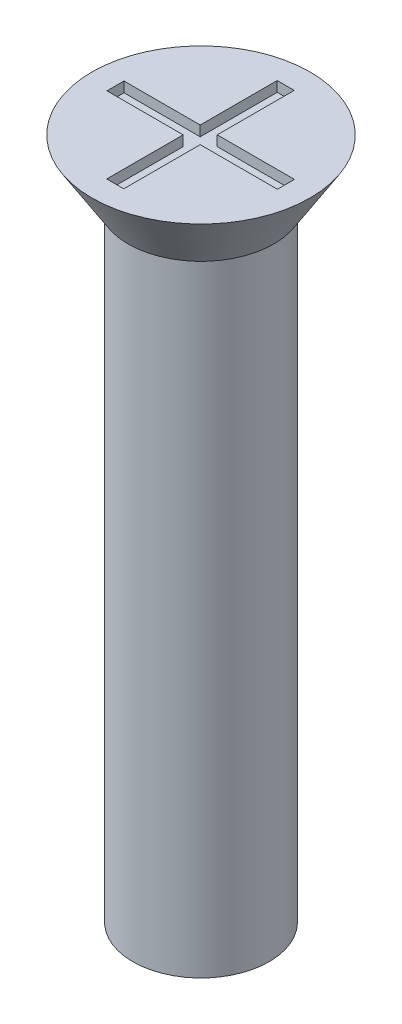
ISO-10303-21;
HEADER;
FILE_DESCRIPTION(('STEP AP214'),'2;1');
FILE_NAME('part.step','',(''),(''),'','','');
FILE_SCHEMA(('AUTOMOTIVE_DESIGN { 1 0 10303 214 1 1 1 1 }'));
ENDSEC;
DATA;
#1=APPLICATION_CONTEXT('core data for automotive mechanical design processes');
#2=APPLICATION_PROTOCOL_DEFINITION('international standard','automotive_design',2000,#1);
#3=PRODUCT_CONTEXT('',#1,'mechanical');
#4=PRODUCT('Part','Part','',(#3));
#5=PRODUCT_RELATED_PRODUCT_CATEGORY('part','',(#4));
#6=PRODUCT_DEFINITION_FORMATION('','',#4);
#7=PRODUCT_DEFINITION_CONTEXT('part definition',#1,'design');
#8=PRODUCT_DEFINITION('design','',#6,#7);
#9=PRODUCT_DEFINITION_SHAPE('','',#8);
#10=(LENGTH_UNIT() NAMED_UNIT(*) SI_UNIT(.MILLI.,.METRE.));
#11=(NAMED_UNIT(*) PLANE_ANGLE_UNIT() SI_UNIT($,.RADIAN.));
#12=(NAMED_UNIT(*) SI_UNIT($,.STERADIAN.) SOLID_ANGLE_UNIT());
#13=UNCERTAINTY_MEASURE_WITH_UNIT(LENGTH_MEASURE(1.E-05),#10,'distance_accuracy_value','');
#14=(GEOMETRIC_REPRESENTATION_CONTEXT(3) GLOBAL_UNCERTAINTY_ASSIGNED_CONTEXT((#13)) GLOBAL_UNIT_ASSIGNED_CONTEXT((#10,
#11,#12)) REPRESENTATION_CONTEXT('',''));
#15=CARTESIAN_POINT('',(0.,0.,0.));
#16=DIRECTION('',(0.,0.,1.));
#17=DIRECTION('',(1.,0.,0.));
#18=AXIS2_PLACEMENT_3D('',#15,#16,#17);
#19=CARTESIAN_POINT('',(0.,20.,0.));
#20=DIRECTION('',(0.,1.,0.));
#21=DIRECTION('',(0.,0.,1.));
#22=AXIS2_PLACEMENT_3D('',#19,#20,#21);
#23=PLANE('',#22);
#24=CARTESIAN_POINT('',(0.,20.,0.));
#25=DIRECTION('',(0.,1.,0.));
#26=DIRECTION('',(0.,0.,1.));
#27=AXIS2_PLACEMENT_3D('',#24,#25,#26);
#28=CIRCLE('',#27,3.2);
#29=CARTESIAN_POINT('',(0.,20.,3.2));
#30=VERTEX_POINT('',#29);
#31=EDGE_CURVE('E192',#30,#30,#28,.T.);
#32=ORIENTED_EDGE('',*,*,#31,.T.);
#33=EDGE_LOOP('',(#32));
#34=FACE_BOUND('',#33,.T.);
#35=DIRECTION('',(1.,0.,0.));
#36=VECTOR('',#35,1.);
#37=CARTESIAN_POINT('',(0.,20.,-2.5));
#38=LINE('',#37,#36);
#39=CARTESIAN_POINT('',(-0.265272843023468,20.,-2.5));
#40=VERTEX_POINT('',#39);
#41=CARTESIAN_POINT('',(0.234727156976532,20.,-2.5));
#42=VERTEX_POINT('',#41);
#43=EDGE_CURVE('E161',#40,#42,#38,.T.);
#44=ORIENTED_EDGE('',*,*,#43,.T.);
#45=DIRECTION('',(0.,0.,1.));
#46=VECTOR('',#45,1.);
#47=CARTESIAN_POINT('',(0.234727156976532,20.,0.));
#48=LINE('',#47,#46);
#49=CARTESIAN_POINT('',(0.234727156976532,20.,-0.241621514992573));
#50=VERTEX_POINT('',#49);
#51=EDGE_CURVE('E48',#42,#50,#48,.T.);
#52=ORIENTED_EDGE('',*,*,#51,.T.);
#53=DIRECTION('',(1.,0.,0.));
#54=VECTOR('',#53,1.);
#55=CARTESIAN_POINT('',(0.,20.,-0.241621514992573));
#56=LINE('',#55,#54);
#57=CARTESIAN_POINT('',(2.5,20.,-0.241621514992573));
#58=VERTEX_POINT('',#57);
#59=EDGE_CURVE('E98',#50,#58,#56,.T.);
#60=ORIENTED_EDGE('',*,*,#59,.T.);
#61=DIRECTION('',(0.,0.,1.));
#62=VECTOR('',#61,1.);
#63=CARTESIAN_POINT('',(2.5,20.,0.));
#64=LINE('',#63,#62);
#65=CARTESIAN_POINT('',(2.5,20.,0.258378485007427));
#66=VERTEX_POINT('',#65);
#67=EDGE_CURVE('E186',#58,#66,#64,.T.);
#68=ORIENTED_EDGE('',*,*,#67,.T.);
#69=DIRECTION('',(1.,0.,0.));
#70=VECTOR('',#69,1.);
#71=CARTESIAN_POINT('',(0.,20.,0.258378485007427));
#72=LINE('',#71,#70);
#73=CARTESIAN_POINT('',(0.234727156976532,20.,0.258378485007427));
#74=VERTEX_POINT('',#73);
#75=EDGE_CURVE('E145',#74,#66,#72,.T.);
#76=ORIENTED_EDGE('',*,*,#75,.F.);
#77=DIRECTION('',(0.,0.,1.));
#78=VECTOR('',#77,1.);
#79=CARTESIAN_POINT('',(0.234727156976532,20.,0.));
#80=LINE('',#79,#78);
#81=CARTESIAN_POINT('',(0.234727156976533,20.,2.5));
#82=VERTEX_POINT('',#81);
#83=EDGE_CURVE('E182',#74,#82,#80,.T.);
#84=ORIENTED_EDGE('',*,*,#83,.T.);
#85=DIRECTION('',(1.,0.,0.));
#86=VECTOR('',#85,1.);
#87=CARTESIAN_POINT('',(0.,20.,2.5));
#88=LINE('',#87,#86);
#89=CARTESIAN_POINT('',(-0.265272843023467,20.,2.5));
#90=VERTEX_POINT('',#89);
#91=EDGE_CURVE('E179',#90,#82,#88,.T.);
#92=ORIENTED_EDGE('',*,*,#91,.F.);
#93=DIRECTION('',(0.,0.,1.));
#94=VECTOR('',#93,1.);
#95=CARTESIAN_POINT('',(-0.265272843023468,20.,0.));
#96=LINE('',#95,#94);
#97=CARTESIAN_POINT('',(-0.265272843023468,20.,0.258378485007427));
#98=VERTEX_POINT('',#97);
#99=EDGE_CURVE('E176',#98,#90,#96,.T.);
#100=ORIENTED_EDGE('',*,*,#99,.F.);
#101=DIRECTION('',(1.,0.,0.));
#102=VECTOR('',#101,1.);
#103=CARTESIAN_POINT('',(0.,20.,0.258378485007427));
#104=LINE('',#103,#102);
#105=CARTESIAN_POINT('',(-2.5,20.,0.258378485007427));
#106=VERTEX_POINT('',#105);
#107=EDGE_CURVE('E173',#106,#98,#104,.T.);
#108=ORIENTED_EDGE('',*,*,#107,.F.);
#109=DIRECTION('',(0.,0.,1.));
#110=VECTOR('',#109,1.);
#111=CARTESIAN_POINT('',(-2.5,20.,0.));
#112=LINE('',#111,#110);
#113=CARTESIAN_POINT('',(-2.5,20.,-0.241621514992573));
#114=VERTEX_POINT('',#113);
#115=EDGE_CURVE('E170',#114,#106,#112,.T.);
#116=ORIENTED_EDGE('',*,*,#115,.F.);
#117=DIRECTION('',(1.,0.,0.));
#118=VECTOR('',#117,1.);
#119=CARTESIAN_POINT('',(0.,20.,-0.241621514992573));
#120=LINE('',#119,#118);
#121=CARTESIAN_POINT('',(-0.265272843023468,20.,-0.241621514992573));
#122=VERTEX_POINT('',#121);
#123=EDGE_CURVE('E167',#114,#122,#120,.T.);
#124=ORIENTED_EDGE('',*,*,#123,.T.);
#125=DIRECTION('',(0.,0.,1.));
#126=VECTOR('',#125,1.);
#127=CARTESIAN_POINT('',(-0.265272843023468,20.,0.));
#128=LINE('',#127,#126);
#129=EDGE_CURVE('E164',#40,#122,#128,.T.);
#130=ORIENTED_EDGE('',*,*,#129,.F.);
#131=EDGE_LOOP('',(#44,#52,#60,#68,#76,#84,#92,#100,#108,#116,#124,#130));
#132=FACE_BOUND('',#131,.T.);
#133=ADVANCED_FACE('F33',(#34,#132),#23,.T.);
#134=CARTESIAN_POINT('',(0.,20.,0.));
#135=DIRECTION('',(0.,-1.,0.));
#136=DIRECTION('',(0.,0.,-1.));
#137=AXIS2_PLACEMENT_3D('',#134,#135,#136);
#138=CYLINDRICAL_SURFACE('',#137,2.);
#139=CARTESIAN_POINT('',(0.,0.,0.));
#140=DIRECTION('',(0.,1.,0.));
#141=DIRECTION('',(0.,0.,1.));
#142=AXIS2_PLACEMENT_3D('',#139,#140,#141);
#143=CIRCLE('',#142,2.);
#144=CARTESIAN_POINT('',(0.,0.,2.));
#145=VERTEX_POINT('',#144);
#146=EDGE_CURVE('E41',#145,#145,#143,.T.);
#147=ORIENTED_EDGE('',*,*,#146,.T.);
#148=EDGE_LOOP('',(#147));
#149=FACE_BOUND('',#148,.T.);
#150=CARTESIAN_POINT('',(0.,18.3,0.));
#151=DIRECTION('',(0.,1.,0.));
#152=DIRECTION('',(0.,0.,1.));
#153=AXIS2_PLACEMENT_3D('',#150,#151,#152);
#154=CIRCLE('',#153,2.);
#155=CARTESIAN_POINT('',(0.,18.3,2.));
#156=VERTEX_POINT('',#155);
#157=EDGE_CURVE('E11',#156,#156,#154,.T.);
#158=ORIENTED_EDGE('',*,*,#157,.F.);
#159=EDGE_LOOP('',(#158));
#160=FACE_BOUND('',#159,.T.);
#161=ADVANCED_FACE('F35',(#149,#160),#138,.T.);
#162=CARTESIAN_POINT('',(0.,0.,0.));
#163=DIRECTION('',(0.,1.,0.));
#164=DIRECTION('',(0.,0.,1.));
#165=AXIS2_PLACEMENT_3D('',#162,#163,#164);
#166=PLANE('',#165);
#167=ORIENTED_EDGE('',*,*,#146,.F.);
#168=EDGE_LOOP('',(#167));
#169=FACE_BOUND('',#168,.T.);
#170=ADVANCED_FACE('F219',(#169),#166,.F.);
#171=CARTESIAN_POINT('',(0.,20.,0.));
#172=DIRECTION('',(0.,1.,0.));
#173=DIRECTION('',(0.,0.,1.));
#174=AXIS2_PLACEMENT_3D('',#171,#172,#173);
#175=CONICAL_SURFACE('',#174,3.2,0.558505360638187);
#176=CARTESIAN_POINT('',(0.,18.3,0.));
#177=DIRECTION('',(0.,1.,0.));
#178=DIRECTION('',(0.,0.,1.));
#179=AXIS2_PLACEMENT_3D('',#176,#177,#178);
#180=CIRCLE('',#179,2.13772210175414);
#181=CARTESIAN_POINT('',(0.,18.3,2.13772210175414));
#182=VERTEX_POINT('',#181);
#183=EDGE_CURVE('E212',#182,#182,#180,.T.);
#184=ORIENTED_EDGE('',*,*,#183,.T.);
#185=EDGE_LOOP('',(#184));
#186=FACE_BOUND('',#185,.T.);
#187=ORIENTED_EDGE('',*,*,#31,.F.);
#188=EDGE_LOOP('',(#187));
#189=FACE_BOUND('',#188,.T.);
#190=ADVANCED_FACE('F221',(#186,#189),#175,.T.);
#191=CARTESIAN_POINT('',(0.,18.3,0.));
#192=DIRECTION('',(0.,1.,0.));
#193=DIRECTION('',(0.,0.,1.));
#194=AXIS2_PLACEMENT_3D('',#191,#192,#193);
#195=PLANE('',#194);
#196=ORIENTED_EDGE('',*,*,#157,.T.);
#197=EDGE_LOOP('',(#196));
#198=FACE_BOUND('',#197,.T.);
#199=ORIENTED_EDGE('',*,*,#183,.F.);
#200=EDGE_LOOP('',(#199));
#201=FACE_BOUND('',#200,.T.);
#202=ADVANCED_FACE('F226',(#198,#201),#195,.F.);
#203=CARTESIAN_POINT('',(0.234727156976532,19.7,0.));
#204=DIRECTION('',(-1.,0.,0.));
#205=DIRECTION('',(0.,0.,1.));
#206=AXIS2_PLACEMENT_3D('',#203,#204,#205);
#207=PLANE('',#206);
#208=ORIENTED_EDGE('',*,*,#51,.F.);
#209=DIRECTION('',(0.,1.,0.));
#210=VECTOR('',#209,1.);
#211=CARTESIAN_POINT('',(0.234727156976532,19.7,-2.5));
#212=LINE('',#211,#210);
#213=CARTESIAN_POINT('',(0.234727156976532,19.7,-2.5));
#214=VERTEX_POINT('',#213);
#215=EDGE_CURVE('E159',#214,#42,#212,.T.);
#216=ORIENTED_EDGE('',*,*,#215,.F.);
#217=DIRECTION('',(0.,0.,1.));
#218=VECTOR('',#217,1.);
#219=CARTESIAN_POINT('',(0.234727156976532,19.7,0.));
#220=LINE('',#219,#218);
#221=CARTESIAN_POINT('',(0.234727156976532,19.7,-0.241621514992573));
#222=VERTEX_POINT('',#221);
#223=EDGE_CURVE('E189',#214,#222,#220,.T.);
#224=ORIENTED_EDGE('',*,*,#223,.T.);
#225=DIRECTION('',(0.,1.,0.));
#226=VECTOR('',#225,1.);
#227=CARTESIAN_POINT('',(0.234727156976532,19.7,-0.241621514992573));
#228=LINE('',#227,#226);
#229=EDGE_CURVE('E190',#222,#50,#228,.T.);
#230=ORIENTED_EDGE('',*,*,#229,.T.);
#231=EDGE_LOOP('',(#208,#216,#224,#230));
#232=FACE_BOUND('',#231,.T.);
#233=ADVANCED_FACE('F238',(#232),#207,.T.);
#234=CARTESIAN_POINT('',(0.,19.7,-0.241621514992573));
#235=DIRECTION('',(0.,0.,1.));
#236=DIRECTION('',(1.,0.,0.));
#237=AXIS2_PLACEMENT_3D('',#234,#235,#236);
#238=PLANE('',#237);
#239=ORIENTED_EDGE('',*,*,#59,.F.);
#240=ORIENTED_EDGE('',*,*,#229,.F.);
#241=DIRECTION('',(1.,0.,0.));
#242=VECTOR('',#241,1.);
#243=CARTESIAN_POINT('',(0.,19.7,-0.241621514992573));
#244=LINE('',#243,#242);
#245=CARTESIAN_POINT('',(2.5,19.7,-0.241621514992573));
#246=VERTEX_POINT('',#245);
#247=EDGE_CURVE('E57',#222,#246,#244,.T.);
#248=ORIENTED_EDGE('',*,*,#247,.T.);
#249=DIRECTION('',(0.,1.,0.));
#250=VECTOR('',#249,1.);
#251=CARTESIAN_POINT('',(2.5,19.7,-0.241621514992573));
#252=LINE('',#251,#250);
#253=EDGE_CURVE('E137',#246,#58,#252,.T.);
#254=ORIENTED_EDGE('',*,*,#253,.T.);
#255=EDGE_LOOP('',(#239,#240,#248,#254));
#256=FACE_BOUND('',#255,.T.);
#257=ADVANCED_FACE('F242',(#256),#238,.T.);
#258=CARTESIAN_POINT('',(2.5,19.7,0.));
#259=DIRECTION('',(-1.,0.,0.));
#260=DIRECTION('',(0.,0.,1.));
#261=AXIS2_PLACEMENT_3D('',#258,#259,#260);
#262=PLANE('',#261);
#263=ORIENTED_EDGE('',*,*,#67,.F.);
#264=ORIENTED_EDGE('',*,*,#253,.F.);
#265=DIRECTION('',(0.,0.,1.));
#266=VECTOR('',#265,1.);
#267=CARTESIAN_POINT('',(2.5,19.7,0.));
#268=LINE('',#267,#266);
#269=CARTESIAN_POINT('',(2.5,19.7,0.258378485007427));
#270=VERTEX_POINT('',#269);
#271=EDGE_CURVE('E131',#246,#270,#268,.T.);
#272=ORIENTED_EDGE('',*,*,#271,.T.);
#273=DIRECTION('',(0.,1.,0.));
#274=VECTOR('',#273,1.);
#275=CARTESIAN_POINT('',(2.5,19.7,0.258378485007427));
#276=LINE('',#275,#274);
#277=EDGE_CURVE('E135',#270,#66,#276,.T.);
#278=ORIENTED_EDGE('',*,*,#277,.T.);
#279=EDGE_LOOP('',(#263,#264,#272,#278));
#280=FACE_BOUND('',#279,.T.);
#281=ADVANCED_FACE('F134',(#280),#262,.T.);
#282=CARTESIAN_POINT('',(0.,19.7,0.258378485007427));
#283=DIRECTION('',(0.,0.,1.));
#284=DIRECTION('',(1.,0.,0.));
#285=AXIS2_PLACEMENT_3D('',#282,#283,#284);
#286=PLANE('',#285);
#287=ORIENTED_EDGE('',*,*,#75,.T.);
#288=ORIENTED_EDGE('',*,*,#277,.F.);
#289=DIRECTION('',(1.,0.,0.));
#290=VECTOR('',#289,1.);
#291=CARTESIAN_POINT('',(0.,19.7,0.258378485007427));
#292=LINE('',#291,#290);
#293=CARTESIAN_POINT('',(0.234727156976532,19.7,0.258378485007427));
#294=VERTEX_POINT('',#293);
#295=EDGE_CURVE('E139',#294,#270,#292,.T.);
#296=ORIENTED_EDGE('',*,*,#295,.F.);
#297=DIRECTION('',(0.,1.,0.));
#298=VECTOR('',#297,1.);
#299=CARTESIAN_POINT('',(0.234727156976532,19.7,0.258378485007427));
#300=LINE('',#299,#298);
#301=EDGE_CURVE('E147',#294,#74,#300,.T.);
#302=ORIENTED_EDGE('',*,*,#301,.T.);
#303=EDGE_LOOP('',(#287,#288,#296,#302));
#304=FACE_BOUND('',#303,.T.);
#305=ADVANCED_FACE('F143',(#304),#286,.F.);
#306=CARTESIAN_POINT('',(0.234727156976532,19.7,0.));
#307=DIRECTION('',(-1.,0.,0.));
#308=DIRECTION('',(0.,0.,1.));
#309=AXIS2_PLACEMENT_3D('',#306,#307,#308);
#310=PLANE('',#309);
#311=ORIENTED_EDGE('',*,*,#83,.F.);
#312=ORIENTED_EDGE('',*,*,#301,.F.);
#313=DIRECTION('',(0.,0.,1.));
#314=VECTOR('',#313,1.);
#315=CARTESIAN_POINT('',(0.234727156976532,19.7,0.));
#316=LINE('',#315,#314);
#317=CARTESIAN_POINT('',(0.234727156976533,19.7,2.5));
#318=VERTEX_POINT('',#317);
#319=EDGE_CURVE('E152',#294,#318,#316,.T.);
#320=ORIENTED_EDGE('',*,*,#319,.T.);
#321=DIRECTION('',(0.,1.,0.));
#322=VECTOR('',#321,1.);
#323=CARTESIAN_POINT('',(0.234727156976533,19.7,2.5));
#324=LINE('',#323,#322);
#325=EDGE_CURVE('E195',#318,#82,#324,.T.);
#326=ORIENTED_EDGE('',*,*,#325,.T.);
#327=EDGE_LOOP('',(#311,#312,#320,#326));
#328=FACE_BOUND('',#327,.T.);
#329=ADVANCED_FACE('F269',(#328),#310,.T.);
#330=CARTESIAN_POINT('',(0.,19.7,2.5));
#331=DIRECTION('',(0.,0.,1.));
#332=DIRECTION('',(1.,0.,0.));
#333=AXIS2_PLACEMENT_3D('',#330,#331,#332);
#334=PLANE('',#333);
#335=ORIENTED_EDGE('',*,*,#91,.T.);
#336=ORIENTED_EDGE('',*,*,#325,.F.);
#337=DIRECTION('',(1.,0.,0.));
#338=VECTOR('',#337,1.);
#339=CARTESIAN_POINT('',(0.,19.7,2.5));
#340=LINE('',#339,#338);
#341=CARTESIAN_POINT('',(-0.265272843023467,19.7,2.5));
#342=VERTEX_POINT('',#341);
#343=EDGE_CURVE('E154',#342,#318,#340,.T.);
#344=ORIENTED_EDGE('',*,*,#343,.F.);
#345=DIRECTION('',(0.,1.,0.));
#346=VECTOR('',#345,1.);
#347=CARTESIAN_POINT('',(-0.265272843023467,19.7,2.5));
#348=LINE('',#347,#346);
#349=EDGE_CURVE('E197',#342,#90,#348,.T.);
#350=ORIENTED_EDGE('',*,*,#349,.T.);
#351=EDGE_LOOP('',(#335,#336,#344,#350));
#352=FACE_BOUND('',#351,.T.);
#353=ADVANCED_FACE('F265',(#352),#334,.F.);
#354=CARTESIAN_POINT('',(-0.265272843023468,19.7,0.));
#355=DIRECTION('',(-1.,0.,0.));
#356=DIRECTION('',(0.,0.,1.));
#357=AXIS2_PLACEMENT_3D('',#354,#355,#356);
#358=PLANE('',#357);
#359=ORIENTED_EDGE('',*,*,#99,.T.);
#360=ORIENTED_EDGE('',*,*,#349,.F.);
#361=DIRECTION('',(0.,0.,1.));
#362=VECTOR('',#361,1.);
#363=CARTESIAN_POINT('',(-0.265272843023468,19.7,0.));
#364=LINE('',#363,#362);
#365=CARTESIAN_POINT('',(-0.265272843023468,19.7,0.258378485007427));
#366=VERTEX_POINT('',#365);
#367=EDGE_CURVE('E417',#366,#342,#364,.T.);
#368=ORIENTED_EDGE('',*,*,#367,.F.);
#369=DIRECTION('',(0.,1.,0.));
#370=VECTOR('',#369,1.);
#371=CARTESIAN_POINT('',(-0.265272843023468,19.7,0.258378485007427));
#372=LINE('',#371,#370);
#373=EDGE_CURVE('E199',#366,#98,#372,.T.);
#374=ORIENTED_EDGE('',*,*,#373,.T.);
#375=EDGE_LOOP('',(#359,#360,#368,#374));
#376=FACE_BOUND('',#375,.T.);
#377=ADVANCED_FACE('F261',(#376),#358,.F.);
#378=CARTESIAN_POINT('',(0.,19.7,0.258378485007427));
#379=DIRECTION('',(0.,0.,1.));
#380=DIRECTION('',(1.,0.,0.));
#381=AXIS2_PLACEMENT_3D('',#378,#379,#380);
#382=PLANE('',#381);
#383=ORIENTED_EDGE('',*,*,#107,.T.);
#384=ORIENTED_EDGE('',*,*,#373,.F.);
#385=DIRECTION('',(1.,0.,0.));
#386=VECTOR('',#385,1.);
#387=CARTESIAN_POINT('',(0.,19.7,0.258378485007427));
#388=LINE('',#387,#386);
#389=CARTESIAN_POINT('',(-2.5,19.7,0.258378485007427));
#390=VERTEX_POINT('',#389);
#391=EDGE_CURVE('E414',#390,#366,#388,.T.);
#392=ORIENTED_EDGE('',*,*,#391,.F.);
#393=DIRECTION('',(0.,1.,0.));
#394=VECTOR('',#393,1.);
#395=CARTESIAN_POINT('',(-2.5,19.7,0.258378485007427));
#396=LINE('',#395,#394);
#397=EDGE_CURVE('E201',#390,#106,#396,.T.);
#398=ORIENTED_EDGE('',*,*,#397,.T.);
#399=EDGE_LOOP('',(#383,#384,#392,#398));
#400=FACE_BOUND('',#399,.T.);
#401=ADVANCED_FACE('F257',(#400),#382,.F.);
#402=CARTESIAN_POINT('',(-2.5,19.7,0.));
#403=DIRECTION('',(-1.,0.,0.));
#404=DIRECTION('',(0.,0.,1.));
#405=AXIS2_PLACEMENT_3D('',#402,#403,#404);
#406=PLANE('',#405);
#407=ORIENTED_EDGE('',*,*,#115,.T.);
#408=ORIENTED_EDGE('',*,*,#397,.F.);
#409=DIRECTION('',(0.,0.,1.));
#410=VECTOR('',#409,1.);
#411=CARTESIAN_POINT('',(-2.5,19.7,0.));
#412=LINE('',#411,#410);
#413=CARTESIAN_POINT('',(-2.5,19.7,-0.241621514992573));
#414=VERTEX_POINT('',#413);
#415=EDGE_CURVE('E411',#414,#390,#412,.T.);
#416=ORIENTED_EDGE('',*,*,#415,.F.);
#417=DIRECTION('',(0.,1.,0.));
#418=VECTOR('',#417,1.);
#419=CARTESIAN_POINT('',(-2.5,19.7,-0.241621514992573));
#420=LINE('',#419,#418);
#421=EDGE_CURVE('E203',#414,#114,#420,.T.);
#422=ORIENTED_EDGE('',*,*,#421,.T.);
#423=EDGE_LOOP('',(#407,#408,#416,#422));
#424=FACE_BOUND('',#423,.T.);
#425=ADVANCED_FACE('F253',(#424),#406,.F.);
#426=CARTESIAN_POINT('',(0.,19.7,-0.241621514992573));
#427=DIRECTION('',(0.,0.,1.));
#428=DIRECTION('',(1.,0.,0.));
#429=AXIS2_PLACEMENT_3D('',#426,#427,#428);
#430=PLANE('',#429);
#431=ORIENTED_EDGE('',*,*,#123,.F.);
#432=ORIENTED_EDGE('',*,*,#421,.F.);
#433=DIRECTION('',(1.,0.,0.));
#434=VECTOR('',#433,1.);
#435=CARTESIAN_POINT('',(0.,19.7,-0.241621514992573));
#436=LINE('',#435,#434);
#437=CARTESIAN_POINT('',(-0.265272843023468,19.7,-0.241621514992573));
#438=VERTEX_POINT('',#437);
#439=EDGE_CURVE('E409',#414,#438,#436,.T.);
#440=ORIENTED_EDGE('',*,*,#439,.T.);
#441=DIRECTION('',(0.,1.,0.));
#442=VECTOR('',#441,1.);
#443=CARTESIAN_POINT('',(-0.265272843023468,19.7,-0.241621514992573));
#444=LINE('',#443,#442);
#445=EDGE_CURVE('E205',#438,#122,#444,.T.);
#446=ORIENTED_EDGE('',*,*,#445,.T.);
#447=EDGE_LOOP('',(#431,#432,#440,#446));
#448=FACE_BOUND('',#447,.T.);
#449=ADVANCED_FACE('F249',(#448),#430,.T.);
#450=CARTESIAN_POINT('',(-0.265272843023468,19.7,0.));
#451=DIRECTION('',(-1.,0.,0.));
#452=DIRECTION('',(0.,0.,1.));
#453=AXIS2_PLACEMENT_3D('',#450,#451,#452);
#454=PLANE('',#453);
#455=ORIENTED_EDGE('',*,*,#129,.T.);
#456=ORIENTED_EDGE('',*,*,#445,.F.);
#457=DIRECTION('',(0.,0.,1.));
#458=VECTOR('',#457,1.);
#459=CARTESIAN_POINT('',(-0.265272843023468,19.7,0.));
#460=LINE('',#459,#458);
#461=CARTESIAN_POINT('',(-0.265272843023468,19.7,-2.5));
#462=VERTEX_POINT('',#461);
#463=EDGE_CURVE('E405',#462,#438,#460,.T.);
#464=ORIENTED_EDGE('',*,*,#463,.F.);
#465=DIRECTION('',(0.,1.,0.));
#466=VECTOR('',#465,1.);
#467=CARTESIAN_POINT('',(-0.265272843023468,19.7,-2.5));
#468=LINE('',#467,#466);
#469=EDGE_CURVE('E207',#462,#40,#468,.T.);
#470=ORIENTED_EDGE('',*,*,#469,.T.);
#471=EDGE_LOOP('',(#455,#456,#464,#470));
#472=FACE_BOUND('',#471,.T.);
#473=ADVANCED_FACE('F246',(#472),#454,.F.);
#474=CARTESIAN_POINT('',(0.,19.7,-2.5));
#475=DIRECTION('',(0.,0.,1.));
#476=DIRECTION('',(1.,0.,0.));
#477=AXIS2_PLACEMENT_3D('',#474,#475,#476);
#478=PLANE('',#477);
#479=ORIENTED_EDGE('',*,*,#43,.F.);
#480=ORIENTED_EDGE('',*,*,#469,.F.);
#481=DIRECTION('',(1.,0.,0.));
#482=VECTOR('',#481,1.);
#483=CARTESIAN_POINT('',(0.,19.7,-2.5));
#484=LINE('',#483,#482);
#485=EDGE_CURVE('E105',#462,#214,#484,.T.);
#486=ORIENTED_EDGE('',*,*,#485,.T.);
#487=ORIENTED_EDGE('',*,*,#215,.T.);
#488=EDGE_LOOP('',(#479,#480,#486,#487));
#489=FACE_BOUND('',#488,.T.);
#490=ADVANCED_FACE('F243',(#489),#478,.T.);
#491=CARTESIAN_POINT('',(0.,19.7,0.));
#492=DIRECTION('',(0.,1.,0.));
#493=DIRECTION('',(0.,0.,1.));
#494=AXIS2_PLACEMENT_3D('',#491,#492,#493);
#495=PLANE('',#494);
#496=ORIENTED_EDGE('',*,*,#223,.F.);
#497=ORIENTED_EDGE('',*,*,#485,.F.);
#498=ORIENTED_EDGE('',*,*,#463,.T.);
#499=ORIENTED_EDGE('',*,*,#439,.F.);
#500=ORIENTED_EDGE('',*,*,#415,.T.);
#501=ORIENTED_EDGE('',*,*,#391,.T.);
#502=ORIENTED_EDGE('',*,*,#367,.T.);
#503=ORIENTED_EDGE('',*,*,#343,.T.);
#504=ORIENTED_EDGE('',*,*,#319,.F.);
#505=ORIENTED_EDGE('',*,*,#295,.T.);
#506=ORIENTED_EDGE('',*,*,#271,.F.);
#507=ORIENTED_EDGE('',*,*,#247,.F.);
#508=EDGE_LOOP('',(#496,#497,#498,#499,#500,#501,#502,#503,#504,#505,#506,#507));
#509=FACE_BOUND('',#508,.T.);
#510=ADVANCED_FACE('F150',(#509),#495,.T.);
#511=CLOSED_SHELL('',(#133,#161,#170,#190,#202,#233,#257,#281,#305,#329,#353,#377,#401,#425,
#449,#473,#490,#510));
#512=MANIFOLD_SOLID_BREP('B2',#511);
#513=ADVANCED_BREP_SHAPE_REPRESENTATION('',(#18,#512),#14);
#514=SHAPE_DEFINITION_REPRESENTATION(#9,#513);
ENDSEC;
END-ISO-10303-21;
